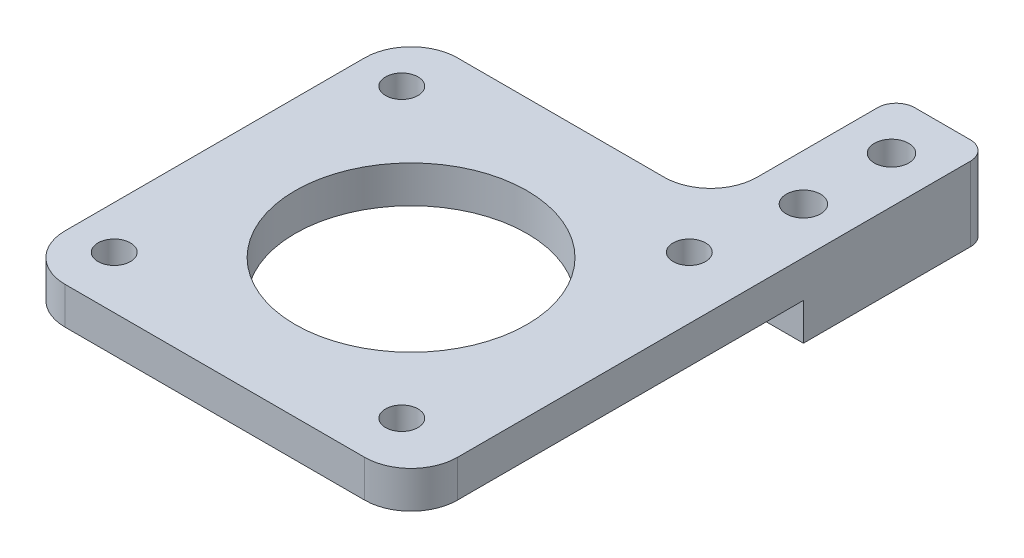
ISO-10303-21;
HEADER;
FILE_DESCRIPTION(('STEP AP214'),'2;1');
FILE_NAME('part.step','',(''),(''),'','','');
FILE_SCHEMA(('AUTOMOTIVE_DESIGN { 1 0 10303 214 1 1 1 1 }'));
ENDSEC;
DATA;
#1=APPLICATION_CONTEXT('core data for automotive mechanical design processes');
#2=APPLICATION_PROTOCOL_DEFINITION('international standard','automotive_design',2000,#1);
#3=PRODUCT_CONTEXT('',#1,'mechanical');
#4=PRODUCT('Part','Part','',(#3));
#5=PRODUCT_RELATED_PRODUCT_CATEGORY('part','',(#4));
#6=PRODUCT_DEFINITION_FORMATION('','',#4);
#7=PRODUCT_DEFINITION_CONTEXT('part definition',#1,'design');
#8=PRODUCT_DEFINITION('design','',#6,#7);
#9=PRODUCT_DEFINITION_SHAPE('','',#8);
#10=(LENGTH_UNIT() NAMED_UNIT(*) SI_UNIT(.MILLI.,.METRE.));
#11=(NAMED_UNIT(*) PLANE_ANGLE_UNIT() SI_UNIT($,.RADIAN.));
#12=(NAMED_UNIT(*) SI_UNIT($,.STERADIAN.) SOLID_ANGLE_UNIT());
#13=UNCERTAINTY_MEASURE_WITH_UNIT(LENGTH_MEASURE(1.E-05),#10,'distance_accuracy_value','');
#14=(GEOMETRIC_REPRESENTATION_CONTEXT(3) GLOBAL_UNCERTAINTY_ASSIGNED_CONTEXT((#13)) GLOBAL_UNIT_ASSIGNED_CONTEXT((#10,
#11,#12)) REPRESENTATION_CONTEXT('',''));
#15=CARTESIAN_POINT('',(0.,0.,0.));
#16=DIRECTION('',(0.,0.,1.));
#17=DIRECTION('',(1.,0.,0.));
#18=AXIS2_PLACEMENT_3D('',#15,#16,#17);
#19=CARTESIAN_POINT('',(0.,0.,0.));
#20=DIRECTION('',(0.,-1.,0.));
#21=DIRECTION('',(0.,0.,-1.));
#22=AXIS2_PLACEMENT_3D('',#19,#20,#21);
#23=PLANE('',#22);
#24=CARTESIAN_POINT('',(-9.5,0.,-21.15));
#25=DIRECTION('',(0.,1.,0.));
#26=DIRECTION('',(0.,0.,1.));
#27=AXIS2_PLACEMENT_3D('',#24,#25,#26);
#28=CIRCLE('',#27,12.5);
#29=CARTESIAN_POINT('',(-9.5,0.,-8.65000000000001));
#30=VERTEX_POINT('',#29);
#31=EDGE_CURVE('E227',#30,#30,#28,.T.);
#32=ORIENTED_EDGE('',*,*,#31,.T.);
#33=EDGE_LOOP('',(#32));
#34=FACE_BOUND('',#33,.T.);
#35=CARTESIAN_POINT('',(-26.,0.,-5.65));
#36=DIRECTION('',(0.,1.,0.));
#37=DIRECTION('',(0.,0.,1.));
#38=AXIS2_PLACEMENT_3D('',#35,#36,#37);
#39=CIRCLE('',#38,1.75);
#40=CARTESIAN_POINT('',(-26.,0.,-3.9));
#41=VERTEX_POINT('',#40);
#42=EDGE_CURVE('E242',#41,#41,#39,.T.);
#43=ORIENTED_EDGE('',*,*,#42,.T.);
#44=EDGE_LOOP('',(#43));
#45=FACE_BOUND('',#44,.T.);
#46=CARTESIAN_POINT('',(5.,0.,-5.65));
#47=DIRECTION('',(0.,1.,0.));
#48=DIRECTION('',(0.,0.,1.));
#49=AXIS2_PLACEMENT_3D('',#46,#47,#48);
#50=CIRCLE('',#49,1.75);
#51=CARTESIAN_POINT('',(5.,0.,-3.9));
#52=VERTEX_POINT('',#51);
#53=EDGE_CURVE('E258',#52,#52,#50,.T.);
#54=ORIENTED_EDGE('',*,*,#53,.T.);
#55=EDGE_LOOP('',(#54));
#56=FACE_BOUND('',#55,.T.);
#57=CARTESIAN_POINT('',(5.,0.,-36.65));
#58=DIRECTION('',(0.,1.,0.));
#59=DIRECTION('',(0.,0.,1.));
#60=AXIS2_PLACEMENT_3D('',#57,#58,#59);
#61=CIRCLE('',#60,1.75);
#62=CARTESIAN_POINT('',(5.,0.,-34.9));
#63=VERTEX_POINT('',#62);
#64=EDGE_CURVE('E250',#63,#63,#61,.T.);
#65=ORIENTED_EDGE('',*,*,#64,.T.);
#66=EDGE_LOOP('',(#65));
#67=FACE_BOUND('',#66,.T.);
#68=CARTESIAN_POINT('',(-26.,0.,-36.65));
#69=DIRECTION('',(0.,1.,0.));
#70=DIRECTION('',(0.,0.,1.));
#71=AXIS2_PLACEMENT_3D('',#68,#69,#70);
#72=CIRCLE('',#71,1.75);
#73=CARTESIAN_POINT('',(-26.,0.,-34.9));
#74=VERTEX_POINT('',#73);
#75=EDGE_CURVE('E234',#74,#74,#72,.T.);
#76=ORIENTED_EDGE('',*,*,#75,.T.);
#77=EDGE_LOOP('',(#76));
#78=FACE_BOUND('',#77,.T.);
#79=DIRECTION('',(-1.,0.,0.));
#80=VECTOR('',#79,1.);
#81=CARTESIAN_POINT('',(-30.65,0.,-42.3));
#82=LINE('',#81,#80);
#83=CARTESIAN_POINT('',(-3.35000000000001,0.,-42.3));
#84=VERTEX_POINT('',#83);
#85=CARTESIAN_POINT('',(-25.65,0.,-42.3));
#86=VERTEX_POINT('',#85);
#87=EDGE_CURVE('E277',#84,#86,#82,.T.);
#88=ORIENTED_EDGE('',*,*,#87,.F.);
#89=DIRECTION('',(1.,0.,0.));
#90=VECTOR('',#89,1.);
#91=CARTESIAN_POINT('',(-3.35000000000001,0.,-42.3));
#92=LINE('',#91,#90);
#93=CARTESIAN_POINT('',(11.65,0.,-42.3));
#94=VERTEX_POINT('',#93);
#95=EDGE_CURVE('E210',#84,#94,#92,.T.);
#96=ORIENTED_EDGE('',*,*,#95,.T.);
#97=DIRECTION('',(0.,0.,-1.));
#98=VECTOR('',#97,1.);
#99=CARTESIAN_POINT('',(11.65,0.,-62.3));
#100=LINE('',#99,#98);
#101=CARTESIAN_POINT('',(11.65,0.,-5.));
#102=VERTEX_POINT('',#101);
#103=EDGE_CURVE('E282',#102,#94,#100,.T.);
#104=ORIENTED_EDGE('',*,*,#103,.F.);
#105=CARTESIAN_POINT('',(6.65000000000002,0.,-5.));
#106=DIRECTION('',(0.,-1.,0.));
#107=DIRECTION('',(0.,0.,-1.));
#108=AXIS2_PLACEMENT_3D('',#105,#106,#107);
#109=CIRCLE('',#108,5.);
#110=CARTESIAN_POINT('',(6.65000000000002,0.,0.));
#111=VERTEX_POINT('',#110);
#112=EDGE_CURVE('E323',#102,#111,#109,.T.);
#113=ORIENTED_EDGE('',*,*,#112,.T.);
#114=DIRECTION('',(1.,0.,0.));
#115=VECTOR('',#114,1.);
#116=CARTESIAN_POINT('',(-30.65,0.,0.));
#117=LINE('',#116,#115);
#118=CARTESIAN_POINT('',(-25.65,0.,0.));
#119=VERTEX_POINT('',#118);
#120=EDGE_CURVE('E306',#119,#111,#117,.T.);
#121=ORIENTED_EDGE('',*,*,#120,.F.);
#122=CARTESIAN_POINT('',(-25.65,0.,-5.));
#123=DIRECTION('',(0.,-1.,0.));
#124=DIRECTION('',(0.,0.,-1.));
#125=AXIS2_PLACEMENT_3D('',#122,#123,#124);
#126=CIRCLE('',#125,5.);
#127=CARTESIAN_POINT('',(-30.65,0.,-5.));
#128=VERTEX_POINT('',#127);
#129=EDGE_CURVE('E320',#119,#128,#126,.T.);
#130=ORIENTED_EDGE('',*,*,#129,.T.);
#131=DIRECTION('',(0.,0.,1.));
#132=VECTOR('',#131,1.);
#133=CARTESIAN_POINT('',(-30.65,0.,0.));
#134=LINE('',#133,#132);
#135=CARTESIAN_POINT('',(-30.65,0.,-37.3));
#136=VERTEX_POINT('',#135);
#137=EDGE_CURVE('E302',#136,#128,#134,.T.);
#138=ORIENTED_EDGE('',*,*,#137,.F.);
#139=CARTESIAN_POINT('',(-25.65,0.,-37.3));
#140=DIRECTION('',(0.,-1.,0.));
#141=DIRECTION('',(0.,0.,-1.));
#142=AXIS2_PLACEMENT_3D('',#139,#140,#141);
#143=CIRCLE('',#142,5.);
#144=EDGE_CURVE('E316',#136,#86,#143,.T.);
#145=ORIENTED_EDGE('',*,*,#144,.T.);
#146=EDGE_LOOP('',(#88,#96,#104,#113,#121,#130,#138,#145));
#147=FACE_BOUND('',#146,.T.);
#148=ADVANCED_FACE('F78',(#34,#45,#56,#67,#78,#147),#23,.T.);
#149=CARTESIAN_POINT('',(0.,4.,0.));
#150=DIRECTION('',(0.,-1.,0.));
#151=DIRECTION('',(0.,0.,-1.));
#152=AXIS2_PLACEMENT_3D('',#149,#150,#151);
#153=PLANE('',#152);
#154=DIRECTION('',(0.,0.,-1.));
#155=VECTOR('',#154,1.);
#156=CARTESIAN_POINT('',(11.65,4.,-42.3));
#157=LINE('',#156,#155);
#158=CARTESIAN_POINT('',(11.65,4.,-5.));
#159=VERTEX_POINT('',#158);
#160=CARTESIAN_POINT('',(11.65,4.,-60.3));
#161=VERTEX_POINT('',#160);
#162=EDGE_CURVE('E293',#159,#161,#157,.T.);
#163=ORIENTED_EDGE('',*,*,#162,.T.);
#164=CARTESIAN_POINT('',(9.64999999999999,4.,-60.3));
#165=DIRECTION('',(0.,-1.,0.));
#166=DIRECTION('',(0.,0.,-1.));
#167=AXIS2_PLACEMENT_3D('',#164,#165,#166);
#168=CIRCLE('',#167,2.);
#169=CARTESIAN_POINT('',(9.64999999999999,4.,-62.3));
#170=VERTEX_POINT('',#169);
#171=EDGE_CURVE('E87',#161,#170,#168,.F.);
#172=ORIENTED_EDGE('',*,*,#171,.T.);
#173=DIRECTION('',(-1.,0.,0.));
#174=VECTOR('',#173,1.);
#175=CARTESIAN_POINT('',(1.64999999999999,4.,-62.3));
#176=LINE('',#175,#174);
#177=CARTESIAN_POINT('',(3.64999999999999,4.,-62.3));
#178=VERTEX_POINT('',#177);
#179=EDGE_CURVE('E296',#170,#178,#176,.T.);
#180=ORIENTED_EDGE('',*,*,#179,.T.);
#181=CARTESIAN_POINT('',(3.64999999999999,4.,-60.3));
#182=DIRECTION('',(0.,-1.,0.));
#183=DIRECTION('',(0.,0.,-1.));
#184=AXIS2_PLACEMENT_3D('',#181,#182,#183);
#185=CIRCLE('',#184,2.);
#186=CARTESIAN_POINT('',(1.64999999999999,4.,-60.3));
#187=VERTEX_POINT('',#186);
#188=EDGE_CURVE('E94',#178,#187,#185,.F.);
#189=ORIENTED_EDGE('',*,*,#188,.T.);
#190=DIRECTION('',(0.,0.,1.));
#191=VECTOR('',#190,1.);
#192=CARTESIAN_POINT('',(1.64999999999999,4.,-42.3));
#193=LINE('',#192,#191);
#194=CARTESIAN_POINT('',(1.64999999999999,4.,-47.3));
#195=VERTEX_POINT('',#194);
#196=EDGE_CURVE('E278',#187,#195,#193,.T.);
#197=ORIENTED_EDGE('',*,*,#196,.T.);
#198=CARTESIAN_POINT('',(-3.35000000000001,4.,-47.3));
#199=DIRECTION('',(0.,-1.,0.));
#200=DIRECTION('',(0.,0.,-1.));
#201=AXIS2_PLACEMENT_3D('',#198,#199,#200);
#202=CIRCLE('',#201,5.);
#203=CARTESIAN_POINT('',(-3.35000000000001,4.,-42.3));
#204=VERTEX_POINT('',#203);
#205=EDGE_CURVE('E187',#195,#204,#202,.T.);
#206=ORIENTED_EDGE('',*,*,#205,.T.);
#207=DIRECTION('',(-1.,0.,0.));
#208=VECTOR('',#207,1.);
#209=CARTESIAN_POINT('',(-30.65,4.,-42.3));
#210=LINE('',#209,#208);
#211=CARTESIAN_POINT('',(-25.65,4.,-42.3));
#212=VERTEX_POINT('',#211);
#213=EDGE_CURVE('E281',#204,#212,#210,.T.);
#214=ORIENTED_EDGE('',*,*,#213,.T.);
#215=CARTESIAN_POINT('',(-25.65,4.,-37.3));
#216=DIRECTION('',(0.,-1.,0.));
#217=DIRECTION('',(0.,0.,-1.));
#218=AXIS2_PLACEMENT_3D('',#215,#216,#217);
#219=CIRCLE('',#218,5.);
#220=CARTESIAN_POINT('',(-30.65,4.,-37.3));
#221=VERTEX_POINT('',#220);
#222=EDGE_CURVE('E333',#212,#221,#219,.F.);
#223=ORIENTED_EDGE('',*,*,#222,.T.);
#224=DIRECTION('',(0.,0.,1.));
#225=VECTOR('',#224,1.);
#226=CARTESIAN_POINT('',(-30.65,4.,0.));
#227=LINE('',#226,#225);
#228=CARTESIAN_POINT('',(-30.65,4.,-5.));
#229=VERTEX_POINT('',#228);
#230=EDGE_CURVE('E285',#221,#229,#227,.T.);
#231=ORIENTED_EDGE('',*,*,#230,.T.);
#232=CARTESIAN_POINT('',(-25.65,4.,-5.));
#233=DIRECTION('',(0.,-1.,0.));
#234=DIRECTION('',(0.,0.,-1.));
#235=AXIS2_PLACEMENT_3D('',#232,#233,#234);
#236=CIRCLE('',#235,5.);
#237=CARTESIAN_POINT('',(-25.65,4.,0.));
#238=VERTEX_POINT('',#237);
#239=EDGE_CURVE('E336',#229,#238,#236,.F.);
#240=ORIENTED_EDGE('',*,*,#239,.T.);
#241=DIRECTION('',(1.,0.,0.));
#242=VECTOR('',#241,1.);
#243=CARTESIAN_POINT('',(-30.65,4.,0.));
#244=LINE('',#243,#242);
#245=CARTESIAN_POINT('',(6.65000000000002,4.,0.));
#246=VERTEX_POINT('',#245);
#247=EDGE_CURVE('E289',#238,#246,#244,.T.);
#248=ORIENTED_EDGE('',*,*,#247,.T.);
#249=CARTESIAN_POINT('',(6.65000000000002,4.,-5.));
#250=DIRECTION('',(0.,-1.,0.));
#251=DIRECTION('',(0.,0.,-1.));
#252=AXIS2_PLACEMENT_3D('',#249,#250,#251);
#253=CIRCLE('',#252,5.);
#254=EDGE_CURVE('E339',#246,#159,#253,.F.);
#255=ORIENTED_EDGE('',*,*,#254,.T.);
#256=EDGE_LOOP('',(#163,#172,#180,#189,#197,#206,#214,#223,#231,#240,#248,#255));
#257=FACE_BOUND('',#256,.T.);
#258=CARTESIAN_POINT('',(6.64999999999999,4.,-56.8));
#259=DIRECTION('',(0.,1.,0.));
#260=DIRECTION('',(0.,0.,1.));
#261=AXIS2_PLACEMENT_3D('',#258,#259,#260);
#262=CIRCLE('',#261,1.85);
#263=CARTESIAN_POINT('',(6.64999999999999,4.,-54.95));
#264=VERTEX_POINT('',#263);
#265=EDGE_CURVE('E273',#264,#264,#262,.T.);
#266=ORIENTED_EDGE('',*,*,#265,.F.);
#267=EDGE_LOOP('',(#266));
#268=FACE_BOUND('',#267,.T.);
#269=CARTESIAN_POINT('',(6.64999999999999,4.,-47.3));
#270=DIRECTION('',(0.,1.,0.));
#271=DIRECTION('',(0.,0.,1.));
#272=AXIS2_PLACEMENT_3D('',#269,#270,#271);
#273=CIRCLE('',#272,1.85);
#274=CARTESIAN_POINT('',(6.64999999999999,4.,-45.45));
#275=VERTEX_POINT('',#274);
#276=EDGE_CURVE('E266',#275,#275,#273,.T.);
#277=ORIENTED_EDGE('',*,*,#276,.F.);
#278=EDGE_LOOP('',(#277));
#279=FACE_BOUND('',#278,.T.);
#280=CARTESIAN_POINT('',(5.,4.,-5.65));
#281=DIRECTION('',(0.,1.,0.));
#282=DIRECTION('',(0.,0.,1.));
#283=AXIS2_PLACEMENT_3D('',#280,#281,#282);
#284=CIRCLE('',#283,1.75);
#285=CARTESIAN_POINT('',(5.,4.,-3.9));
#286=VERTEX_POINT('',#285);
#287=EDGE_CURVE('E262',#286,#286,#284,.T.);
#288=ORIENTED_EDGE('',*,*,#287,.F.);
#289=EDGE_LOOP('',(#288));
#290=FACE_BOUND('',#289,.T.);
#291=CARTESIAN_POINT('',(5.,4.,-36.65));
#292=DIRECTION('',(0.,1.,0.));
#293=DIRECTION('',(0.,0.,1.));
#294=AXIS2_PLACEMENT_3D('',#291,#292,#293);
#295=CIRCLE('',#294,1.75);
#296=CARTESIAN_POINT('',(5.,4.,-34.9));
#297=VERTEX_POINT('',#296);
#298=EDGE_CURVE('E254',#297,#297,#295,.T.);
#299=ORIENTED_EDGE('',*,*,#298,.F.);
#300=EDGE_LOOP('',(#299));
#301=FACE_BOUND('',#300,.T.);
#302=CARTESIAN_POINT('',(-26.,4.,-5.65));
#303=DIRECTION('',(0.,1.,0.));
#304=DIRECTION('',(0.,0.,1.));
#305=AXIS2_PLACEMENT_3D('',#302,#303,#304);
#306=CIRCLE('',#305,1.75);
#307=CARTESIAN_POINT('',(-26.,4.,-3.9));
#308=VERTEX_POINT('',#307);
#309=EDGE_CURVE('E246',#308,#308,#306,.T.);
#310=ORIENTED_EDGE('',*,*,#309,.F.);
#311=EDGE_LOOP('',(#310));
#312=FACE_BOUND('',#311,.T.);
#313=CARTESIAN_POINT('',(-26.,4.,-36.65));
#314=DIRECTION('',(0.,1.,0.));
#315=DIRECTION('',(0.,0.,1.));
#316=AXIS2_PLACEMENT_3D('',#313,#314,#315);
#317=CIRCLE('',#316,1.75);
#318=CARTESIAN_POINT('',(-26.,4.,-34.9));
#319=VERTEX_POINT('',#318);
#320=EDGE_CURVE('E238',#319,#319,#317,.T.);
#321=ORIENTED_EDGE('',*,*,#320,.F.);
#322=EDGE_LOOP('',(#321));
#323=FACE_BOUND('',#322,.T.);
#324=CARTESIAN_POINT('',(-9.5,4.,-21.15));
#325=DIRECTION('',(0.,1.,0.));
#326=DIRECTION('',(0.,0.,1.));
#327=AXIS2_PLACEMENT_3D('',#324,#325,#326);
#328=CIRCLE('',#327,12.5);
#329=CARTESIAN_POINT('',(-9.5,4.,-8.65000000000001));
#330=VERTEX_POINT('',#329);
#331=EDGE_CURVE('E230',#330,#330,#328,.T.);
#332=ORIENTED_EDGE('',*,*,#331,.F.);
#333=EDGE_LOOP('',(#332));
#334=FACE_BOUND('',#333,.T.);
#335=ADVANCED_FACE('F377',(#257,#268,#279,#290,#301,#312,#323,#334),#153,.F.);
#336=CARTESIAN_POINT('',(1.64999999999999,4.,-42.3));
#337=DIRECTION('',(1.,0.,0.));
#338=DIRECTION('',(0.,0.,-1.));
#339=AXIS2_PLACEMENT_3D('',#336,#337,#338);
#340=PLANE('',#339);
#341=ORIENTED_EDGE('',*,*,#196,.F.);
#342=DIRECTION('',(0.,-1.,0.));
#343=VECTOR('',#342,1.);
#344=CARTESIAN_POINT('',(1.64999999999999,4.,-60.3));
#345=LINE('',#344,#343);
#346=CARTESIAN_POINT('',(1.64999999999999,-4.,-60.3));
#347=VERTEX_POINT('',#346);
#348=EDGE_CURVE('E12',#187,#347,#345,.T.);
#349=ORIENTED_EDGE('',*,*,#348,.T.);
#350=DIRECTION('',(0.,0.,-1.));
#351=VECTOR('',#350,1.);
#352=CARTESIAN_POINT('',(1.64999999999999,-4.,-47.3));
#353=LINE('',#352,#351);
#354=CARTESIAN_POINT('',(1.64999999999999,-4.,-47.3));
#355=VERTEX_POINT('',#354);
#356=EDGE_CURVE('E198',#355,#347,#353,.T.);
#357=ORIENTED_EDGE('',*,*,#356,.F.);
#358=DIRECTION('',(0.,-1.,0.));
#359=VECTOR('',#358,1.);
#360=CARTESIAN_POINT('',(1.64999999999999,4.,-47.3));
#361=LINE('',#360,#359);
#362=EDGE_CURVE('E181',#355,#195,#361,.F.);
#363=ORIENTED_EDGE('',*,*,#362,.T.);
#364=EDGE_LOOP('',(#341,#349,#357,#363));
#365=FACE_BOUND('',#364,.T.);
#366=ADVANCED_FACE('F203',(#365),#340,.F.);
#367=CARTESIAN_POINT('',(-30.65,4.,-42.3));
#368=DIRECTION('',(0.,0.,1.));
#369=DIRECTION('',(1.,0.,0.));
#370=AXIS2_PLACEMENT_3D('',#367,#368,#369);
#371=PLANE('',#370);
#372=ORIENTED_EDGE('',*,*,#213,.F.);
#373=DIRECTION('',(0.,-1.,0.));
#374=VECTOR('',#373,1.);
#375=CARTESIAN_POINT('',(-3.35000000000001,0.,-42.3));
#376=LINE('',#375,#374);
#377=EDGE_CURVE('E191',#204,#84,#376,.T.);
#378=ORIENTED_EDGE('',*,*,#377,.T.);
#379=ORIENTED_EDGE('',*,*,#87,.T.);
#380=DIRECTION('',(0.,-1.,0.));
#381=VECTOR('',#380,1.);
#382=CARTESIAN_POINT('',(-25.65,4.,-42.3));
#383=LINE('',#382,#381);
#384=EDGE_CURVE('E349',#86,#212,#383,.F.);
#385=ORIENTED_EDGE('',*,*,#384,.T.);
#386=EDGE_LOOP('',(#372,#378,#379,#385));
#387=FACE_BOUND('',#386,.T.);
#388=ADVANCED_FACE('F394',(#387),#371,.F.);
#389=CARTESIAN_POINT('',(-30.65,4.,0.));
#390=DIRECTION('',(1.,0.,0.));
#391=DIRECTION('',(0.,0.,-1.));
#392=AXIS2_PLACEMENT_3D('',#389,#390,#391);
#393=PLANE('',#392);
#394=ORIENTED_EDGE('',*,*,#137,.T.);
#395=DIRECTION('',(0.,-1.,0.));
#396=VECTOR('',#395,1.);
#397=CARTESIAN_POINT('',(-30.65,4.,-5.));
#398=LINE('',#397,#396);
#399=EDGE_CURVE('E346',#128,#229,#398,.F.);
#400=ORIENTED_EDGE('',*,*,#399,.T.);
#401=ORIENTED_EDGE('',*,*,#230,.F.);
#402=DIRECTION('',(0.,-1.,0.));
#403=VECTOR('',#402,1.);
#404=CARTESIAN_POINT('',(-30.65,4.,-37.3));
#405=LINE('',#404,#403);
#406=EDGE_CURVE('E342',#221,#136,#405,.T.);
#407=ORIENTED_EDGE('',*,*,#406,.T.);
#408=EDGE_LOOP('',(#394,#400,#401,#407));
#409=FACE_BOUND('',#408,.T.);
#410=ADVANCED_FACE('F405',(#409),#393,.F.);
#411=CARTESIAN_POINT('',(-30.65,4.,0.));
#412=DIRECTION('',(0.,0.,-1.));
#413=DIRECTION('',(-1.,0.,0.));
#414=AXIS2_PLACEMENT_3D('',#411,#412,#413);
#415=PLANE('',#414);
#416=ORIENTED_EDGE('',*,*,#120,.T.);
#417=DIRECTION('',(0.,-1.,0.));
#418=VECTOR('',#417,1.);
#419=CARTESIAN_POINT('',(6.65000000000002,4.,0.));
#420=LINE('',#419,#418);
#421=EDGE_CURVE('E330',#111,#246,#420,.F.);
#422=ORIENTED_EDGE('',*,*,#421,.T.);
#423=ORIENTED_EDGE('',*,*,#247,.F.);
#424=DIRECTION('',(0.,-1.,0.));
#425=VECTOR('',#424,1.);
#426=CARTESIAN_POINT('',(-25.65,4.,0.));
#427=LINE('',#426,#425);
#428=EDGE_CURVE('E326',#238,#119,#427,.T.);
#429=ORIENTED_EDGE('',*,*,#428,.T.);
#430=EDGE_LOOP('',(#416,#422,#423,#429));
#431=FACE_BOUND('',#430,.T.);
#432=ADVANCED_FACE('F413',(#431),#415,.F.);
#433=CARTESIAN_POINT('',(11.65,4.,-62.3));
#434=DIRECTION('',(-1.,0.,0.));
#435=DIRECTION('',(0.,0.,1.));
#436=AXIS2_PLACEMENT_3D('',#433,#434,#435);
#437=PLANE('',#436);
#438=DIRECTION('',(0.,0.,1.));
#439=VECTOR('',#438,1.);
#440=CARTESIAN_POINT('',(11.65,-4.,-62.3));
#441=LINE('',#440,#439);
#442=CARTESIAN_POINT('',(11.65,-4.,-60.3));
#443=VERTEX_POINT('',#442);
#444=CARTESIAN_POINT('',(11.65,-4.,-42.3));
#445=VERTEX_POINT('',#444);
#446=EDGE_CURVE('E216',#443,#445,#441,.T.);
#447=ORIENTED_EDGE('',*,*,#446,.F.);
#448=DIRECTION('',(0.,-1.,0.));
#449=VECTOR('',#448,1.);
#450=CARTESIAN_POINT('',(11.65,4.,-60.3));
#451=LINE('',#450,#449);
#452=EDGE_CURVE('E102',#443,#161,#451,.F.);
#453=ORIENTED_EDGE('',*,*,#452,.T.);
#454=ORIENTED_EDGE('',*,*,#162,.F.);
#455=DIRECTION('',(0.,-1.,0.));
#456=VECTOR('',#455,1.);
#457=CARTESIAN_POINT('',(11.65,4.,-5.));
#458=LINE('',#457,#456);
#459=EDGE_CURVE('E299',#159,#102,#458,.T.);
#460=ORIENTED_EDGE('',*,*,#459,.T.);
#461=ORIENTED_EDGE('',*,*,#103,.T.);
#462=DIRECTION('',(0.,1.,0.));
#463=VECTOR('',#462,1.);
#464=CARTESIAN_POINT('',(11.65,-4.,-42.3));
#465=LINE('',#464,#463);
#466=EDGE_CURVE('E224',#445,#94,#465,.T.);
#467=ORIENTED_EDGE('',*,*,#466,.F.);
#468=EDGE_LOOP('',(#447,#453,#454,#460,#461,#467));
#469=FACE_BOUND('',#468,.T.);
#470=ADVANCED_FACE('F386',(#469),#437,.F.);
#471=CARTESIAN_POINT('',(1.64999999999999,4.,-62.3));
#472=DIRECTION('',(0.,0.,1.));
#473=DIRECTION('',(1.,0.,0.));
#474=AXIS2_PLACEMENT_3D('',#471,#472,#473);
#475=PLANE('',#474);
#476=ORIENTED_EDGE('',*,*,#179,.F.);
#477=DIRECTION('',(0.,-1.,0.));
#478=VECTOR('',#477,1.);
#479=CARTESIAN_POINT('',(9.64999999999999,4.,-62.3));
#480=LINE('',#479,#478);
#481=CARTESIAN_POINT('',(9.64999999999999,-4.,-62.3));
#482=VERTEX_POINT('',#481);
#483=EDGE_CURVE('E361',#170,#482,#480,.T.);
#484=ORIENTED_EDGE('',*,*,#483,.T.);
#485=DIRECTION('',(-1.,0.,0.));
#486=VECTOR('',#485,1.);
#487=CARTESIAN_POINT('',(11.65,-4.,-62.3));
#488=LINE('',#487,#486);
#489=CARTESIAN_POINT('',(3.64999999999999,-4.,-62.3));
#490=VERTEX_POINT('',#489);
#491=EDGE_CURVE('E206',#482,#490,#488,.T.);
#492=ORIENTED_EDGE('',*,*,#491,.T.);
#493=DIRECTION('',(0.,-1.,0.));
#494=VECTOR('',#493,1.);
#495=CARTESIAN_POINT('',(3.64999999999999,4.,-62.3));
#496=LINE('',#495,#494);
#497=EDGE_CURVE('E358',#490,#178,#496,.F.);
#498=ORIENTED_EDGE('',*,*,#497,.T.);
#499=EDGE_LOOP('',(#476,#484,#492,#498));
#500=FACE_BOUND('',#499,.T.);
#501=ADVANCED_FACE('F382',(#500),#475,.F.);
#502=CARTESIAN_POINT('',(6.64999999999999,4.,-56.8));
#503=DIRECTION('',(0.,-1.,0.));
#504=DIRECTION('',(0.,0.,-1.));
#505=AXIS2_PLACEMENT_3D('',#502,#503,#504);
#506=CYLINDRICAL_SURFACE('',#505,1.85);
#507=ORIENTED_EDGE('',*,*,#265,.T.);
#508=EDGE_LOOP('',(#507));
#509=FACE_BOUND('',#508,.T.);
#510=CARTESIAN_POINT('',(6.64999999999999,-4.,-56.8));
#511=DIRECTION('',(0.,-1.,0.));
#512=DIRECTION('',(0.,0.,-1.));
#513=AXIS2_PLACEMENT_3D('',#510,#511,#512);
#514=CIRCLE('',#513,1.85);
#515=CARTESIAN_POINT('',(6.64999999999999,-4.,-58.65));
#516=VERTEX_POINT('',#515);
#517=EDGE_CURVE('E713',#516,#516,#514,.T.);
#518=ORIENTED_EDGE('',*,*,#517,.T.);
#519=EDGE_LOOP('',(#518));
#520=FACE_BOUND('',#519,.T.);
#521=ADVANCED_FACE('F443',(#509,#520),#506,.F.);
#522=CARTESIAN_POINT('',(6.64999999999999,4.,-47.3));
#523=DIRECTION('',(0.,-1.,0.));
#524=DIRECTION('',(0.,0.,-1.));
#525=AXIS2_PLACEMENT_3D('',#522,#523,#524);
#526=CYLINDRICAL_SURFACE('',#525,1.85);
#527=ORIENTED_EDGE('',*,*,#276,.T.);
#528=EDGE_LOOP('',(#527));
#529=FACE_BOUND('',#528,.T.);
#530=CARTESIAN_POINT('',(6.64999999999999,-4.,-47.3));
#531=DIRECTION('',(0.,-1.,0.));
#532=DIRECTION('',(0.,0.,-1.));
#533=AXIS2_PLACEMENT_3D('',#530,#531,#532);
#534=CIRCLE('',#533,1.85);
#535=CARTESIAN_POINT('',(6.64999999999999,-4.,-49.15));
#536=VERTEX_POINT('',#535);
#537=EDGE_CURVE('E223',#536,#536,#534,.T.);
#538=ORIENTED_EDGE('',*,*,#537,.T.);
#539=EDGE_LOOP('',(#538));
#540=FACE_BOUND('',#539,.T.);
#541=ADVANCED_FACE('F484',(#529,#540),#526,.F.);
#542=CARTESIAN_POINT('',(5.,4.,-5.65));
#543=DIRECTION('',(0.,-1.,0.));
#544=DIRECTION('',(0.,0.,-1.));
#545=AXIS2_PLACEMENT_3D('',#542,#543,#544);
#546=CYLINDRICAL_SURFACE('',#545,1.75);
#547=ORIENTED_EDGE('',*,*,#287,.T.);
#548=EDGE_LOOP('',(#547));
#549=FACE_BOUND('',#548,.T.);
#550=ORIENTED_EDGE('',*,*,#53,.F.);
#551=EDGE_LOOP('',(#550));
#552=FACE_BOUND('',#551,.T.);
#553=ADVANCED_FACE('F491',(#549,#552),#546,.F.);
#554=CARTESIAN_POINT('',(5.,4.,-36.65));
#555=DIRECTION('',(0.,-1.,0.));
#556=DIRECTION('',(0.,0.,-1.));
#557=AXIS2_PLACEMENT_3D('',#554,#555,#556);
#558=CYLINDRICAL_SURFACE('',#557,1.75);
#559=ORIENTED_EDGE('',*,*,#298,.T.);
#560=EDGE_LOOP('',(#559));
#561=FACE_BOUND('',#560,.T.);
#562=ORIENTED_EDGE('',*,*,#64,.F.);
#563=EDGE_LOOP('',(#562));
#564=FACE_BOUND('',#563,.T.);
#565=ADVANCED_FACE('F500',(#561,#564),#558,.F.);
#566=CARTESIAN_POINT('',(-26.,4.,-5.65));
#567=DIRECTION('',(0.,-1.,0.));
#568=DIRECTION('',(0.,0.,-1.));
#569=AXIS2_PLACEMENT_3D('',#566,#567,#568);
#570=CYLINDRICAL_SURFACE('',#569,1.75);
#571=ORIENTED_EDGE('',*,*,#309,.T.);
#572=EDGE_LOOP('',(#571));
#573=FACE_BOUND('',#572,.T.);
#574=ORIENTED_EDGE('',*,*,#42,.F.);
#575=EDGE_LOOP('',(#574));
#576=FACE_BOUND('',#575,.T.);
#577=ADVANCED_FACE('F508',(#573,#576),#570,.F.);
#578=CARTESIAN_POINT('',(-26.,4.,-36.65));
#579=DIRECTION('',(0.,-1.,0.));
#580=DIRECTION('',(0.,0.,-1.));
#581=AXIS2_PLACEMENT_3D('',#578,#579,#580);
#582=CYLINDRICAL_SURFACE('',#581,1.75);
#583=ORIENTED_EDGE('',*,*,#320,.T.);
#584=EDGE_LOOP('',(#583));
#585=FACE_BOUND('',#584,.T.);
#586=ORIENTED_EDGE('',*,*,#75,.F.);
#587=EDGE_LOOP('',(#586));
#588=FACE_BOUND('',#587,.T.);
#589=ADVANCED_FACE('F427',(#585,#588),#582,.F.);
#590=CARTESIAN_POINT('',(-9.5,4.,-21.15));
#591=DIRECTION('',(0.,-1.,0.));
#592=DIRECTION('',(0.,0.,-1.));
#593=AXIS2_PLACEMENT_3D('',#590,#591,#592);
#594=CYLINDRICAL_SURFACE('',#593,12.5);
#595=ORIENTED_EDGE('',*,*,#331,.T.);
#596=EDGE_LOOP('',(#595));
#597=FACE_BOUND('',#596,.T.);
#598=ORIENTED_EDGE('',*,*,#31,.F.);
#599=EDGE_LOOP('',(#598));
#600=FACE_BOUND('',#599,.T.);
#601=ADVANCED_FACE('F420',(#597,#600),#594,.F.);
#602=CARTESIAN_POINT('',(6.65000000000002,4.,-5.));
#603=DIRECTION('',(0.,-1.,0.));
#604=DIRECTION('',(0.,0.,-1.));
#605=AXIS2_PLACEMENT_3D('',#602,#603,#604);
#606=CYLINDRICAL_SURFACE('',#605,5.);
#607=ORIENTED_EDGE('',*,*,#254,.F.);
#608=ORIENTED_EDGE('',*,*,#421,.F.);
#609=ORIENTED_EDGE('',*,*,#112,.F.);
#610=ORIENTED_EDGE('',*,*,#459,.F.);
#611=EDGE_LOOP('',(#607,#608,#609,#610));
#612=FACE_BOUND('',#611,.T.);
#613=ADVANCED_FACE('F417',(#612),#606,.T.);
#614=CARTESIAN_POINT('',(-25.65,4.,-5.));
#615=DIRECTION('',(0.,-1.,0.));
#616=DIRECTION('',(0.,0.,-1.));
#617=AXIS2_PLACEMENT_3D('',#614,#615,#616);
#618=CYLINDRICAL_SURFACE('',#617,5.);
#619=ORIENTED_EDGE('',*,*,#239,.F.);
#620=ORIENTED_EDGE('',*,*,#399,.F.);
#621=ORIENTED_EDGE('',*,*,#129,.F.);
#622=ORIENTED_EDGE('',*,*,#428,.F.);
#623=EDGE_LOOP('',(#619,#620,#621,#622));
#624=FACE_BOUND('',#623,.T.);
#625=ADVANCED_FACE('F408',(#624),#618,.T.);
#626=CARTESIAN_POINT('',(-25.65,4.,-37.3));
#627=DIRECTION('',(0.,-1.,0.));
#628=DIRECTION('',(0.,0.,-1.));
#629=AXIS2_PLACEMENT_3D('',#626,#627,#628);
#630=CYLINDRICAL_SURFACE('',#629,5.);
#631=ORIENTED_EDGE('',*,*,#222,.F.);
#632=ORIENTED_EDGE('',*,*,#384,.F.);
#633=ORIENTED_EDGE('',*,*,#144,.F.);
#634=ORIENTED_EDGE('',*,*,#406,.F.);
#635=EDGE_LOOP('',(#631,#632,#633,#634));
#636=FACE_BOUND('',#635,.T.);
#637=ADVANCED_FACE('F401',(#636),#630,.T.);
#638=CARTESIAN_POINT('',(-3.35000000000001,4.,-47.3));
#639=DIRECTION('',(0.,1.,0.));
#640=DIRECTION('',(0.,0.,1.));
#641=AXIS2_PLACEMENT_3D('',#638,#639,#640);
#642=CYLINDRICAL_SURFACE('',#641,5.);
#643=ORIENTED_EDGE('',*,*,#205,.F.);
#644=ORIENTED_EDGE('',*,*,#362,.F.);
#645=CARTESIAN_POINT('',(-3.35000000000001,-4.,-47.3));
#646=DIRECTION('',(0.,1.,0.));
#647=DIRECTION('',(0.,0.,1.));
#648=AXIS2_PLACEMENT_3D('',#645,#646,#647);
#649=CIRCLE('',#648,5.);
#650=CARTESIAN_POINT('',(-3.35000000000001,-4.,-42.3));
#651=VERTEX_POINT('',#650);
#652=EDGE_CURVE('E184',#651,#355,#649,.T.);
#653=ORIENTED_EDGE('',*,*,#652,.F.);
#654=DIRECTION('',(0.,1.,0.));
#655=VECTOR('',#654,1.);
#656=CARTESIAN_POINT('',(-3.35000000000001,-4.,-42.3));
#657=LINE('',#656,#655);
#658=EDGE_CURVE('E219',#651,#84,#657,.T.);
#659=ORIENTED_EDGE('',*,*,#658,.T.);
#660=ORIENTED_EDGE('',*,*,#377,.F.);
#661=EDGE_LOOP('',(#643,#644,#653,#659,#660));
#662=FACE_BOUND('',#661,.T.);
#663=ADVANCED_FACE('F183',(#662),#642,.F.);
#664=CARTESIAN_POINT('',(-3.35000000000001,-4.,-47.3));
#665=DIRECTION('',(0.,1.,0.));
#666=DIRECTION('',(0.,0.,1.));
#667=AXIS2_PLACEMENT_3D('',#664,#665,#666);
#668=PLANE('',#667);
#669=ORIENTED_EDGE('',*,*,#491,.F.);
#670=CARTESIAN_POINT('',(9.64999999999999,-4.,-60.3));
#671=DIRECTION('',(0.,1.,0.));
#672=DIRECTION('',(0.,0.,1.));
#673=AXIS2_PLACEMENT_3D('',#670,#671,#672);
#674=CIRCLE('',#673,2.);
#675=EDGE_CURVE('E368',#482,#443,#674,.F.);
#676=ORIENTED_EDGE('',*,*,#675,.T.);
#677=ORIENTED_EDGE('',*,*,#446,.T.);
#678=DIRECTION('',(1.,0.,0.));
#679=VECTOR('',#678,1.);
#680=CARTESIAN_POINT('',(-3.35000000000001,-4.,-42.3));
#681=LINE('',#680,#679);
#682=EDGE_CURVE('E200',#651,#445,#681,.T.);
#683=ORIENTED_EDGE('',*,*,#682,.F.);
#684=ORIENTED_EDGE('',*,*,#652,.T.);
#685=ORIENTED_EDGE('',*,*,#356,.T.);
#686=CARTESIAN_POINT('',(3.64999999999999,-4.,-60.3));
#687=DIRECTION('',(0.,1.,0.));
#688=DIRECTION('',(0.,0.,1.));
#689=AXIS2_PLACEMENT_3D('',#686,#687,#688);
#690=CIRCLE('',#689,2.);
#691=EDGE_CURVE('E365',#347,#490,#690,.F.);
#692=ORIENTED_EDGE('',*,*,#691,.T.);
#693=EDGE_LOOP('',(#669,#676,#677,#683,#684,#685,#692));
#694=FACE_BOUND('',#693,.T.);
#695=ORIENTED_EDGE('',*,*,#537,.F.);
#696=EDGE_LOOP('',(#695));
#697=FACE_BOUND('',#696,.T.);
#698=ORIENTED_EDGE('',*,*,#517,.F.);
#699=EDGE_LOOP('',(#698));
#700=FACE_BOUND('',#699,.T.);
#701=ADVANCED_FACE('F196',(#694,#697,#700),#668,.F.);
#702=CARTESIAN_POINT('',(-3.35000000000001,-4.,-42.3));
#703=DIRECTION('',(0.,0.,1.));
#704=DIRECTION('',(1.,0.,0.));
#705=AXIS2_PLACEMENT_3D('',#702,#703,#704);
#706=PLANE('',#705);
#707=ORIENTED_EDGE('',*,*,#95,.F.);
#708=ORIENTED_EDGE('',*,*,#658,.F.);
#709=ORIENTED_EDGE('',*,*,#682,.T.);
#710=ORIENTED_EDGE('',*,*,#466,.T.);
#711=EDGE_LOOP('',(#707,#708,#709,#710));
#712=FACE_BOUND('',#711,.T.);
#713=ADVANCED_FACE('F390',(#712),#706,.T.);
#714=CARTESIAN_POINT('',(9.64999999999999,4.,-60.3));
#715=DIRECTION('',(0.,-1.,0.));
#716=DIRECTION('',(0.,0.,-1.));
#717=AXIS2_PLACEMENT_3D('',#714,#715,#716);
#718=CYLINDRICAL_SURFACE('',#717,2.);
#719=ORIENTED_EDGE('',*,*,#171,.F.);
#720=ORIENTED_EDGE('',*,*,#452,.F.);
#721=ORIENTED_EDGE('',*,*,#675,.F.);
#722=ORIENTED_EDGE('',*,*,#483,.F.);
#723=EDGE_LOOP('',(#719,#720,#721,#722));
#724=FACE_BOUND('',#723,.T.);
#725=ADVANCED_FACE('F384',(#724),#718,.T.);
#726=CARTESIAN_POINT('',(3.64999999999999,4.,-60.3));
#727=DIRECTION('',(0.,-1.,0.));
#728=DIRECTION('',(0.,0.,-1.));
#729=AXIS2_PLACEMENT_3D('',#726,#727,#728);
#730=CYLINDRICAL_SURFACE('',#729,2.);
#731=ORIENTED_EDGE('',*,*,#188,.F.);
#732=ORIENTED_EDGE('',*,*,#497,.F.);
#733=ORIENTED_EDGE('',*,*,#691,.F.);
#734=ORIENTED_EDGE('',*,*,#348,.F.);
#735=EDGE_LOOP('',(#731,#732,#733,#734));
#736=FACE_BOUND('',#735,.T.);
#737=ADVANCED_FACE('F80',(#736),#730,.T.);
#738=CLOSED_SHELL('',(#148,#335,#366,#388,#410,#432,#470,#501,#521,#541,#553,#565,#577,#589,
#601,#613,#625,#637,#663,#701,#713,#725,#737));
#739=MANIFOLD_SOLID_BREP('B2',#738);
#740=ADVANCED_BREP_SHAPE_REPRESENTATION('',(#18,#739),#14);
#741=SHAPE_DEFINITION_REPRESENTATION(#9,#740);
ENDSEC;
END-ISO-10303-21;
